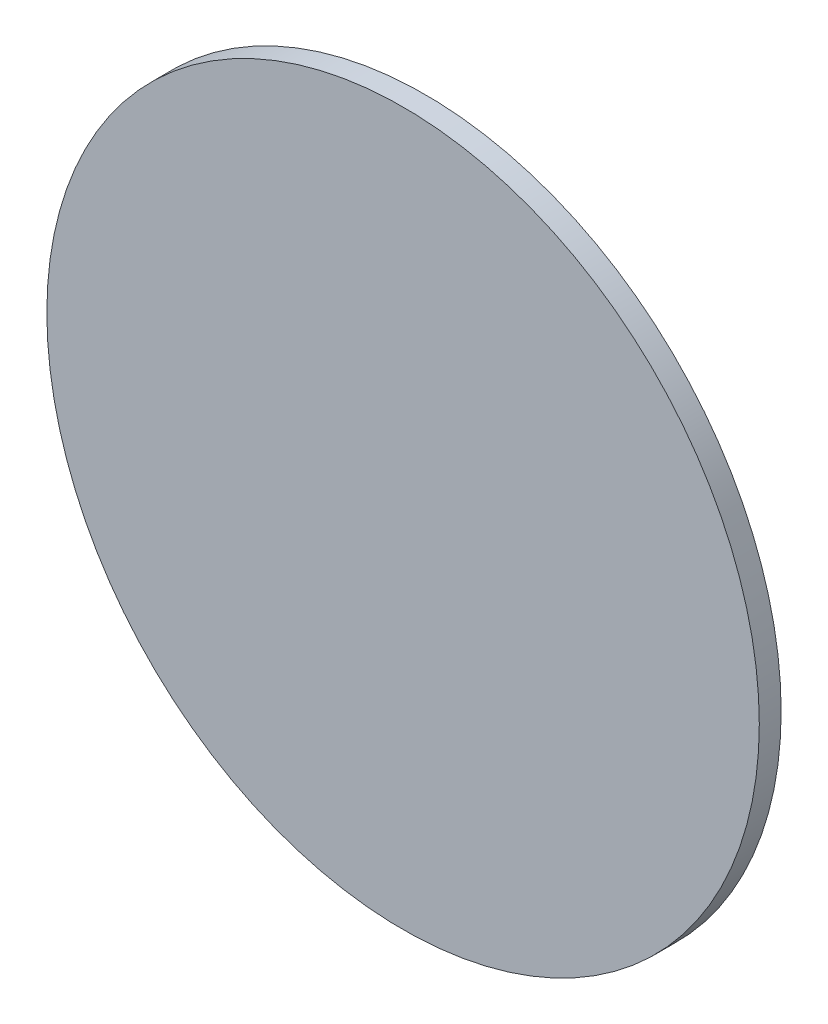
ISO-10303-21;
HEADER;
FILE_DESCRIPTION(('STEP AP214'),'2;1');
FILE_NAME('part.step','',(''),(''),'','','');
FILE_SCHEMA(('AUTOMOTIVE_DESIGN { 1 0 10303 214 1 1 1 1 }'));
ENDSEC;
DATA;
#1=APPLICATION_CONTEXT('core data for automotive mechanical design processes');
#2=APPLICATION_PROTOCOL_DEFINITION('international standard','automotive_design',2000,#1);
#3=PRODUCT_CONTEXT('',#1,'mechanical');
#4=PRODUCT('Part','Part','',(#3));
#5=PRODUCT_RELATED_PRODUCT_CATEGORY('part','',(#4));
#6=PRODUCT_DEFINITION_FORMATION('','',#4);
#7=PRODUCT_DEFINITION_CONTEXT('part definition',#1,'design');
#8=PRODUCT_DEFINITION('design','',#6,#7);
#9=PRODUCT_DEFINITION_SHAPE('','',#8);
#10=(LENGTH_UNIT() NAMED_UNIT(*) SI_UNIT(.MILLI.,.METRE.));
#11=(NAMED_UNIT(*) PLANE_ANGLE_UNIT() SI_UNIT($,.RADIAN.));
#12=(NAMED_UNIT(*) SI_UNIT($,.STERADIAN.) SOLID_ANGLE_UNIT());
#13=UNCERTAINTY_MEASURE_WITH_UNIT(LENGTH_MEASURE(1.E-05),#10,'distance_accuracy_value','');
#14=(GEOMETRIC_REPRESENTATION_CONTEXT(3) GLOBAL_UNCERTAINTY_ASSIGNED_CONTEXT((#13)) GLOBAL_UNIT_ASSIGNED_CONTEXT((#10,
#11,#12)) REPRESENTATION_CONTEXT('',''));
#15=CARTESIAN_POINT('',(0.,0.,0.));
#16=DIRECTION('',(0.,0.,1.));
#17=DIRECTION('',(1.,0.,0.));
#18=AXIS2_PLACEMENT_3D('',#15,#16,#17);
#19=CARTESIAN_POINT('',(-5.45782393561467,0.,2.3));
#20=DIRECTION('',(0.,0.,-1.));
#21=DIRECTION('',(-1.,0.,0.));
#22=AXIS2_PLACEMENT_3D('',#19,#20,#21);
#23=CYLINDRICAL_SURFACE('',#22,37.5);
#24=CARTESIAN_POINT('',(-5.45782393561467,0.,2.3));
#25=DIRECTION('',(0.,0.,1.));
#26=DIRECTION('',(1.,0.,0.));
#27=AXIS2_PLACEMENT_3D('',#24,#25,#26);
#28=CIRCLE('',#27,37.5);
#29=CARTESIAN_POINT('',(32.0421760643853,0.,2.3));
#30=VERTEX_POINT('',#29);
#31=EDGE_CURVE('E10',#30,#30,#28,.T.);
#32=ORIENTED_EDGE('',*,*,#31,.F.);
#33=EDGE_LOOP('',(#32));
#34=FACE_BOUND('',#33,.T.);
#35=CARTESIAN_POINT('',(-5.45782393561467,0.,0.));
#36=DIRECTION('',(0.,0.,1.));
#37=DIRECTION('',(1.,0.,0.));
#38=AXIS2_PLACEMENT_3D('',#35,#36,#37);
#39=CIRCLE('',#38,37.5);
#40=CARTESIAN_POINT('',(32.0421760643853,0.,0.));
#41=VERTEX_POINT('',#40);
#42=EDGE_CURVE('E38',#41,#41,#39,.T.);
#43=ORIENTED_EDGE('',*,*,#42,.T.);
#44=EDGE_LOOP('',(#43));
#45=FACE_BOUND('',#44,.T.);
#46=ADVANCED_FACE('F35',(#34,#45),#23,.T.);
#47=CARTESIAN_POINT('',(-5.45782393561467,0.,2.3));
#48=DIRECTION('',(0.,0.,1.));
#49=DIRECTION('',(1.,0.,0.));
#50=AXIS2_PLACEMENT_3D('',#47,#48,#49);
#51=PLANE('',#50);
#52=ORIENTED_EDGE('',*,*,#31,.T.);
#53=EDGE_LOOP('',(#52));
#54=FACE_BOUND('',#53,.T.);
#55=ADVANCED_FACE('F50',(#54),#51,.T.);
#56=CARTESIAN_POINT('',(-5.45782393561467,0.,0.));
#57=DIRECTION('',(0.,0.,1.));
#58=DIRECTION('',(1.,0.,0.));
#59=AXIS2_PLACEMENT_3D('',#56,#57,#58);
#60=PLANE('',#59);
#61=ORIENTED_EDGE('',*,*,#42,.F.);
#62=EDGE_LOOP('',(#61));
#63=FACE_BOUND('',#62,.T.);
#64=ADVANCED_FACE('F48',(#63),#60,.F.);
#65=CLOSED_SHELL('',(#46,#55,#64));
#66=MANIFOLD_SOLID_BREP('B2',#65);
#67=ADVANCED_BREP_SHAPE_REPRESENTATION('',(#18,#66),#14);
#68=SHAPE_DEFINITION_REPRESENTATION(#9,#67);
ENDSEC;
END-ISO-10303-21;
